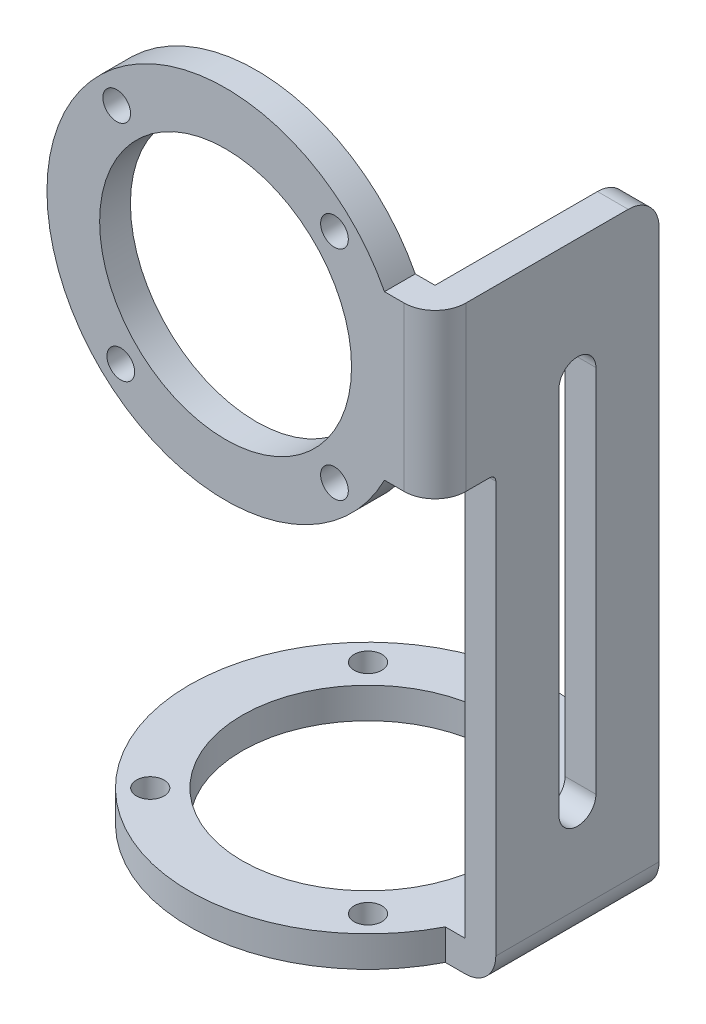
ISO-10303-21;
HEADER;
FILE_DESCRIPTION(('STEP AP214'),'2;1');
FILE_NAME('part.step','',(''),(''),'','','');
FILE_SCHEMA(('AUTOMOTIVE_DESIGN { 1 0 10303 214 1 1 1 1 }'));
ENDSEC;
DATA;
#1=APPLICATION_CONTEXT('core data for automotive mechanical design processes');
#2=APPLICATION_PROTOCOL_DEFINITION('international standard','automotive_design',2000,#1);
#3=PRODUCT_CONTEXT('',#1,'mechanical');
#4=PRODUCT('Part','Part','',(#3));
#5=PRODUCT_RELATED_PRODUCT_CATEGORY('part','',(#4));
#6=PRODUCT_DEFINITION_FORMATION('','',#4);
#7=PRODUCT_DEFINITION_CONTEXT('part definition',#1,'design');
#8=PRODUCT_DEFINITION('design','',#6,#7);
#9=PRODUCT_DEFINITION_SHAPE('','',#8);
#10=(LENGTH_UNIT() NAMED_UNIT(*) SI_UNIT(.MILLI.,.METRE.));
#11=(NAMED_UNIT(*) PLANE_ANGLE_UNIT() SI_UNIT($,.RADIAN.));
#12=(NAMED_UNIT(*) SI_UNIT($,.STERADIAN.) SOLID_ANGLE_UNIT());
#13=UNCERTAINTY_MEASURE_WITH_UNIT(LENGTH_MEASURE(1.E-05),#10,'distance_accuracy_value','');
#14=(GEOMETRIC_REPRESENTATION_CONTEXT(3) GLOBAL_UNCERTAINTY_ASSIGNED_CONTEXT((#13)) GLOBAL_UNIT_ASSIGNED_CONTEXT((#10,
#11,#12)) REPRESENTATION_CONTEXT('',''));
#15=CARTESIAN_POINT('',(0.,0.,0.));
#16=DIRECTION('',(0.,0.,1.));
#17=DIRECTION('',(1.,0.,0.));
#18=AXIS2_PLACEMENT_3D('',#15,#16,#17);
#19=CARTESIAN_POINT('',(34.,8.24999999999991,-26.375));
#20=DIRECTION('',(-1.,0.,0.));
#21=DIRECTION('',(0.,0.,1.));
#22=AXIS2_PLACEMENT_3D('',#19,#20,#21);
#23=PLANE('',#22);
#24=DIRECTION('',(0.,0.,-1.));
#25=VECTOR('',#24,1.);
#26=CARTESIAN_POINT('',(34.,-13.25,0.));
#27=LINE('',#26,#25);
#28=CARTESIAN_POINT('',(34.,-13.25,0.));
#29=VERTEX_POINT('',#28);
#30=CARTESIAN_POINT('',(34.,-13.25,-3.875));
#31=VERTEX_POINT('',#30);
#32=EDGE_CURVE('E207',#29,#31,#27,.T.);
#33=ORIENTED_EDGE('',*,*,#32,.T.);
#34=CARTESIAN_POINT('',(34.,-14.25,-3.875));
#35=DIRECTION('',(1.,0.,0.));
#36=DIRECTION('',(0.,0.,-1.));
#37=AXIS2_PLACEMENT_3D('',#34,#35,#36);
#38=CIRCLE('',#37,1.);
#39=CARTESIAN_POINT('',(34.,-14.25,-4.87499999999998));
#40=VERTEX_POINT('',#39);
#41=EDGE_CURVE('E228',#40,#31,#38,.T.);
#42=ORIENTED_EDGE('',*,*,#41,.F.);
#43=DIRECTION('',(0.,1.,0.));
#44=VECTOR('',#43,1.);
#45=CARTESIAN_POINT('',(34.,-81.,-4.87499999999998));
#46=LINE('',#45,#44);
#47=CARTESIAN_POINT('',(34.,-81.,-4.87499999999998));
#48=VERTEX_POINT('',#47);
#49=EDGE_CURVE('E216',#48,#40,#46,.T.);
#50=ORIENTED_EDGE('',*,*,#49,.F.);
#51=DIRECTION('',(0.,0.,1.));
#52=VECTOR('',#51,1.);
#53=CARTESIAN_POINT('',(34.,-81.,-31.375));
#54=LINE('',#53,#52);
#55=CARTESIAN_POINT('',(34.,-81.,-31.375));
#56=VERTEX_POINT('',#55);
#57=EDGE_CURVE('E336',#56,#48,#54,.T.);
#58=ORIENTED_EDGE('',*,*,#57,.F.);
#59=DIRECTION('',(0.,-1.,0.));
#60=VECTOR('',#59,1.);
#61=CARTESIAN_POINT('',(34.,8.24999999999988,-31.375));
#62=LINE('',#61,#60);
#63=CARTESIAN_POINT('',(34.,8.24999999999988,-31.375));
#64=VERTEX_POINT('',#63);
#65=EDGE_CURVE('E241',#64,#56,#62,.T.);
#66=ORIENTED_EDGE('',*,*,#65,.F.);
#67=CARTESIAN_POINT('',(34.,8.24999999999991,-26.375));
#68=DIRECTION('',(-1.,0.,0.));
#69=DIRECTION('',(0.,0.,1.));
#70=AXIS2_PLACEMENT_3D('',#67,#68,#69);
#71=CIRCLE('',#70,5.);
#72=CARTESIAN_POINT('',(34.,13.2499999999999,-26.375));
#73=VERTEX_POINT('',#72);
#74=EDGE_CURVE('E245',#73,#64,#71,.T.);
#75=ORIENTED_EDGE('',*,*,#74,.F.);
#76=DIRECTION('',(0.,0.,-1.));
#77=VECTOR('',#76,1.);
#78=CARTESIAN_POINT('',(34.,13.2499999999999,0.));
#79=LINE('',#78,#77);
#80=CARTESIAN_POINT('',(34.,13.2499999999999,0.));
#81=VERTEX_POINT('',#80);
#82=EDGE_CURVE('E250',#81,#73,#79,.T.);
#83=ORIENTED_EDGE('',*,*,#82,.F.);
#84=DIRECTION('',(0.,1.,0.));
#85=VECTOR('',#84,1.);
#86=CARTESIAN_POINT('',(34.,-13.25,0.));
#87=LINE('',#86,#85);
#88=EDGE_CURVE('E282',#29,#81,#87,.T.);
#89=ORIENTED_EDGE('',*,*,#88,.F.);
#90=EDGE_LOOP('',(#33,#42,#50,#58,#66,#75,#83,#89));
#91=FACE_BOUND('',#90,.T.);
#92=DIRECTION('',(0.,-1.,0.));
#93=VECTOR('',#92,1.);
#94=CARTESIAN_POINT('',(34.,0.,-21.125));
#95=LINE('',#94,#93);
#96=CARTESIAN_POINT('',(34.,-6.37500000000002,-21.125));
#97=VERTEX_POINT('',#96);
#98=CARTESIAN_POINT('',(34.,-66.375,-21.125));
#99=VERTEX_POINT('',#98);
#100=EDGE_CURVE('E67',#97,#99,#95,.T.);
#101=ORIENTED_EDGE('',*,*,#100,.T.);
#102=CARTESIAN_POINT('',(34.,-66.375,-18.125));
#103=DIRECTION('',(1.,0.,0.));
#104=DIRECTION('',(0.,0.,-1.));
#105=AXIS2_PLACEMENT_3D('',#102,#103,#104);
#106=CIRCLE('',#105,3.);
#107=CARTESIAN_POINT('',(34.,-66.375,-15.125));
#108=VERTEX_POINT('',#107);
#109=EDGE_CURVE('E196',#99,#108,#106,.F.);
#110=ORIENTED_EDGE('',*,*,#109,.T.);
#111=DIRECTION('',(0.,-1.,0.));
#112=VECTOR('',#111,1.);
#113=CARTESIAN_POINT('',(34.,0.,-15.125));
#114=LINE('',#113,#112);
#115=CARTESIAN_POINT('',(34.,-6.37500000000002,-15.125));
#116=VERTEX_POINT('',#115);
#117=EDGE_CURVE('E180',#116,#108,#114,.T.);
#118=ORIENTED_EDGE('',*,*,#117,.F.);
#119=CARTESIAN_POINT('',(34.,-6.37500000000002,-18.125));
#120=DIRECTION('',(1.,0.,0.));
#121=DIRECTION('',(0.,0.,-1.));
#122=AXIS2_PLACEMENT_3D('',#119,#120,#121);
#123=CIRCLE('',#122,2.99999999999999);
#124=EDGE_CURVE('E190',#97,#116,#123,.T.);
#125=ORIENTED_EDGE('',*,*,#124,.F.);
#126=EDGE_LOOP('',(#101,#110,#118,#125));
#127=FACE_BOUND('',#126,.T.);
#128=ADVANCED_FACE('F49',(#91,#127),#23,.F.);
#129=CARTESIAN_POINT('',(29.,8.24999999999991,-26.375));
#130=DIRECTION('',(-1.,0.,0.));
#131=DIRECTION('',(0.,0.,1.));
#132=AXIS2_PLACEMENT_3D('',#129,#130,#131);
#133=PLANE('',#132);
#134=CARTESIAN_POINT('',(29.,-14.25,-3.87499999999999));
#135=DIRECTION('',(1.,0.,0.));
#136=DIRECTION('',(0.,0.,-1.));
#137=AXIS2_PLACEMENT_3D('',#134,#135,#136);
#138=CIRCLE('',#137,1.);
#139=CARTESIAN_POINT('',(29.,-14.25,-4.875));
#140=VERTEX_POINT('',#139);
#141=CARTESIAN_POINT('',(29.,-13.25,-3.87499999999999));
#142=VERTEX_POINT('',#141);
#143=EDGE_CURVE('E215',#140,#142,#138,.T.);
#144=ORIENTED_EDGE('',*,*,#143,.T.);
#145=DIRECTION('',(0.,0.,-1.));
#146=VECTOR('',#145,1.);
#147=CARTESIAN_POINT('',(29.,-13.25,0.));
#148=LINE('',#147,#146);
#149=CARTESIAN_POINT('',(29.,-13.25,0.));
#150=VERTEX_POINT('',#149);
#151=EDGE_CURVE('E212',#150,#142,#148,.T.);
#152=ORIENTED_EDGE('',*,*,#151,.F.);
#153=DIRECTION('',(0.,-1.,0.));
#154=VECTOR('',#153,1.);
#155=CARTESIAN_POINT('',(29.,-13.25,0.));
#156=LINE('',#155,#154);
#157=CARTESIAN_POINT('',(29.,13.2499999999999,0.));
#158=VERTEX_POINT('',#157);
#159=EDGE_CURVE('E240',#158,#150,#156,.T.);
#160=ORIENTED_EDGE('',*,*,#159,.F.);
#161=DIRECTION('',(0.,0.,-1.));
#162=VECTOR('',#161,1.);
#163=CARTESIAN_POINT('',(29.,13.2499999999999,0.));
#164=LINE('',#163,#162);
#165=CARTESIAN_POINT('',(29.,13.2499999999999,-26.375));
#166=VERTEX_POINT('',#165);
#167=EDGE_CURVE('E246',#158,#166,#164,.T.);
#168=ORIENTED_EDGE('',*,*,#167,.T.);
#169=CARTESIAN_POINT('',(29.,8.24999999999991,-26.375));
#170=DIRECTION('',(-1.,0.,0.));
#171=DIRECTION('',(0.,0.,1.));
#172=AXIS2_PLACEMENT_3D('',#169,#170,#171);
#173=CIRCLE('',#172,5.);
#174=CARTESIAN_POINT('',(29.,8.24999999999988,-31.375));
#175=VERTEX_POINT('',#174);
#176=EDGE_CURVE('E265',#166,#175,#173,.T.);
#177=ORIENTED_EDGE('',*,*,#176,.T.);
#178=DIRECTION('',(0.,-1.,0.));
#179=VECTOR('',#178,1.);
#180=CARTESIAN_POINT('',(29.,8.24999999999988,-31.375));
#181=LINE('',#180,#179);
#182=CARTESIAN_POINT('',(29.,-81.,-31.375));
#183=VERTEX_POINT('',#182);
#184=EDGE_CURVE('E262',#175,#183,#181,.T.);
#185=ORIENTED_EDGE('',*,*,#184,.T.);
#186=DIRECTION('',(0.,0.,-1.));
#187=VECTOR('',#186,1.);
#188=CARTESIAN_POINT('',(29.,-81.,0.));
#189=LINE('',#188,#187);
#190=CARTESIAN_POINT('',(29.,-81.,-4.875));
#191=VERTEX_POINT('',#190);
#192=EDGE_CURVE('E258',#191,#183,#189,.T.);
#193=ORIENTED_EDGE('',*,*,#192,.F.);
#194=DIRECTION('',(0.,1.,0.));
#195=VECTOR('',#194,1.);
#196=CARTESIAN_POINT('',(29.,-81.,-4.875));
#197=LINE('',#196,#195);
#198=EDGE_CURVE('E220',#191,#140,#197,.T.);
#199=ORIENTED_EDGE('',*,*,#198,.T.);
#200=EDGE_LOOP('',(#144,#152,#160,#168,#177,#185,#193,#199));
#201=FACE_BOUND('',#200,.T.);
#202=CARTESIAN_POINT('',(29.,-66.375,-18.125));
#203=DIRECTION('',(-1.,0.,0.));
#204=DIRECTION('',(0.,0.,1.));
#205=AXIS2_PLACEMENT_3D('',#202,#203,#204);
#206=CIRCLE('',#205,3.);
#207=CARTESIAN_POINT('',(29.,-66.375,-15.125));
#208=VERTEX_POINT('',#207);
#209=CARTESIAN_POINT('',(29.0000000000001,-66.375,-21.125));
#210=VERTEX_POINT('',#209);
#211=EDGE_CURVE('E59',#208,#210,#206,.F.);
#212=ORIENTED_EDGE('',*,*,#211,.T.);
#213=DIRECTION('',(0.,1.,0.));
#214=VECTOR('',#213,1.);
#215=CARTESIAN_POINT('',(29.,8.24999999999991,-21.125));
#216=LINE('',#215,#214);
#217=CARTESIAN_POINT('',(29.,-6.37500000000002,-21.125));
#218=VERTEX_POINT('',#217);
#219=EDGE_CURVE('E11',#210,#218,#216,.T.);
#220=ORIENTED_EDGE('',*,*,#219,.T.);
#221=CARTESIAN_POINT('',(29.,-6.37500000000002,-18.125));
#222=DIRECTION('',(-1.,0.,0.));
#223=DIRECTION('',(0.,0.,1.));
#224=AXIS2_PLACEMENT_3D('',#221,#222,#223);
#225=CIRCLE('',#224,2.99999999999999);
#226=CARTESIAN_POINT('',(29.,-6.37500000000002,-15.125));
#227=VERTEX_POINT('',#226);
#228=EDGE_CURVE('E385',#227,#218,#225,.T.);
#229=ORIENTED_EDGE('',*,*,#228,.F.);
#230=DIRECTION('',(0.,1.,0.));
#231=VECTOR('',#230,1.);
#232=CARTESIAN_POINT('',(29.,8.24999999999991,-15.125));
#233=LINE('',#232,#231);
#234=EDGE_CURVE('E183',#208,#227,#233,.T.);
#235=ORIENTED_EDGE('',*,*,#234,.F.);
#236=EDGE_LOOP('',(#212,#220,#229,#235));
#237=FACE_BOUND('',#236,.T.);
#238=ADVANCED_FACE('F513',(#201,#237),#133,.T.);
#239=CARTESIAN_POINT('',(0.,-86.,-18.125));
#240=DIRECTION('',(0.,1.,0.));
#241=DIRECTION('',(0.,0.,1.));
#242=AXIS2_PLACEMENT_3D('',#239,#240,#241);
#243=CYLINDRICAL_SURFACE('',#242,29.);
#244=CARTESIAN_POINT('',(0.,-81.,-18.125));
#245=DIRECTION('',(0.,-1.,0.));
#246=DIRECTION('',(0.,0.,-1.));
#247=AXIS2_PLACEMENT_3D('',#244,#245,#246);
#248=CIRCLE('',#247,29.);
#249=CARTESIAN_POINT('',(25.7960752828798,-81.,-4.87499999999996));
#250=VERTEX_POINT('',#249);
#251=CARTESIAN_POINT('',(25.7960752828798,-81.,-31.375));
#252=VERTEX_POINT('',#251);
#253=EDGE_CURVE('E343',#250,#252,#248,.T.);
#254=ORIENTED_EDGE('',*,*,#253,.T.);
#255=DIRECTION('',(0.,1.,0.));
#256=VECTOR('',#255,1.);
#257=CARTESIAN_POINT('',(25.7960752828798,-86.,-31.375));
#258=LINE('',#257,#256);
#259=CARTESIAN_POINT('',(25.7960752828798,-86.,-31.375));
#260=VERTEX_POINT('',#259);
#261=EDGE_CURVE('E381',#260,#252,#258,.T.);
#262=ORIENTED_EDGE('',*,*,#261,.F.);
#263=CARTESIAN_POINT('',(0.,-86.,-18.125));
#264=DIRECTION('',(0.,-1.,0.));
#265=DIRECTION('',(0.,0.,-1.));
#266=AXIS2_PLACEMENT_3D('',#263,#264,#265);
#267=CIRCLE('',#266,29.);
#268=CARTESIAN_POINT('',(25.7960752828798,-86.,-4.87499999999996));
#269=VERTEX_POINT('',#268);
#270=EDGE_CURVE('E344',#269,#260,#267,.T.);
#271=ORIENTED_EDGE('',*,*,#270,.F.);
#272=DIRECTION('',(0.,1.,0.));
#273=VECTOR('',#272,1.);
#274=CARTESIAN_POINT('',(25.7960752828798,-86.,-4.87499999999996));
#275=LINE('',#274,#273);
#276=EDGE_CURVE('E364',#269,#250,#275,.T.);
#277=ORIENTED_EDGE('',*,*,#276,.T.);
#278=EDGE_LOOP('',(#254,#262,#271,#277));
#279=FACE_BOUND('',#278,.T.);
#280=ADVANCED_FACE('F51',(#279),#243,.T.);
#281=CARTESIAN_POINT('',(0.,-86.,-31.375));
#282=DIRECTION('',(0.,0.,1.));
#283=DIRECTION('',(1.,0.,0.));
#284=AXIS2_PLACEMENT_3D('',#281,#282,#283);
#285=PLANE('',#284);
#286=DIRECTION('',(1.,0.,0.));
#287=VECTOR('',#286,1.);
#288=CARTESIAN_POINT('',(0.,-81.,-31.375));
#289=LINE('',#288,#287);
#290=EDGE_CURVE('E368',#252,#183,#289,.T.);
#291=ORIENTED_EDGE('',*,*,#290,.T.);
#292=ORIENTED_EDGE('',*,*,#184,.F.);
#293=DIRECTION('',(-1.,0.,0.));
#294=VECTOR('',#293,1.);
#295=CARTESIAN_POINT('',(34.,8.24999999999988,-31.375));
#296=LINE('',#295,#294);
#297=EDGE_CURVE('E274',#64,#175,#296,.T.);
#298=ORIENTED_EDGE('',*,*,#297,.F.);
#299=ORIENTED_EDGE('',*,*,#65,.T.);
#300=CARTESIAN_POINT('',(29.,-81.,-31.375));
#301=DIRECTION('',(0.,0.,1.));
#302=DIRECTION('',(1.,0.,0.));
#303=AXIS2_PLACEMENT_3D('',#300,#301,#302);
#304=CIRCLE('',#303,5.);
#305=CARTESIAN_POINT('',(29.,-86.,-31.375));
#306=VERTEX_POINT('',#305);
#307=EDGE_CURVE('E332',#306,#56,#304,.T.);
#308=ORIENTED_EDGE('',*,*,#307,.F.);
#309=DIRECTION('',(1.,0.,0.));
#310=VECTOR('',#309,1.);
#311=CARTESIAN_POINT('',(0.,-86.,-31.375));
#312=LINE('',#311,#310);
#313=EDGE_CURVE('E348',#260,#306,#312,.T.);
#314=ORIENTED_EDGE('',*,*,#313,.F.);
#315=ORIENTED_EDGE('',*,*,#261,.T.);
#316=EDGE_LOOP('',(#291,#292,#298,#299,#308,#314,#315));
#317=FACE_BOUND('',#316,.T.);
#318=ADVANCED_FACE('F581',(#317),#285,.F.);
#319=CARTESIAN_POINT('',(0.,-86.,-4.87499999999999));
#320=DIRECTION('',(0.,0.,1.));
#321=DIRECTION('',(1.,0.,0.));
#322=AXIS2_PLACEMENT_3D('',#319,#320,#321);
#323=PLANE('',#322);
#324=DIRECTION('',(1.,0.,0.));
#325=VECTOR('',#324,1.);
#326=CARTESIAN_POINT('',(0.,-81.,-4.87499999999999));
#327=LINE('',#326,#325);
#328=EDGE_CURVE('E372',#250,#191,#327,.T.);
#329=ORIENTED_EDGE('',*,*,#328,.F.);
#330=ORIENTED_EDGE('',*,*,#276,.F.);
#331=DIRECTION('',(1.,0.,0.));
#332=VECTOR('',#331,1.);
#333=CARTESIAN_POINT('',(0.,-86.,-4.87499999999999));
#334=LINE('',#333,#332);
#335=CARTESIAN_POINT('',(29.,-86.,-4.875));
#336=VERTEX_POINT('',#335);
#337=EDGE_CURVE('E356',#269,#336,#334,.T.);
#338=ORIENTED_EDGE('',*,*,#337,.T.);
#339=CARTESIAN_POINT('',(29.,-81.,-4.875));
#340=DIRECTION('',(0.,0.,1.));
#341=DIRECTION('',(1.,0.,0.));
#342=AXIS2_PLACEMENT_3D('',#339,#340,#341);
#343=CIRCLE('',#342,5.);
#344=EDGE_CURVE('E331',#336,#48,#343,.T.);
#345=ORIENTED_EDGE('',*,*,#344,.T.);
#346=ORIENTED_EDGE('',*,*,#49,.T.);
#347=DIRECTION('',(1.,0.,0.));
#348=VECTOR('',#347,1.);
#349=CARTESIAN_POINT('',(29.,-14.25,-4.875));
#350=LINE('',#349,#348);
#351=EDGE_CURVE('E224',#140,#40,#350,.T.);
#352=ORIENTED_EDGE('',*,*,#351,.F.);
#353=ORIENTED_EDGE('',*,*,#198,.F.);
#354=EDGE_LOOP('',(#329,#330,#338,#345,#346,#352,#353));
#355=FACE_BOUND('',#354,.T.);
#356=ADVANCED_FACE('F497',(#355),#323,.T.);
#357=CARTESIAN_POINT('',(0.,-86.,-18.125));
#358=DIRECTION('',(0.,1.,0.));
#359=DIRECTION('',(0.,0.,1.));
#360=AXIS2_PLACEMENT_3D('',#357,#358,#359);
#361=CYLINDRICAL_SURFACE('',#360,20.45);
#362=CARTESIAN_POINT('',(0.,-86.,-18.125));
#363=DIRECTION('',(0.,-1.,0.));
#364=DIRECTION('',(0.,0.,-1.));
#365=AXIS2_PLACEMENT_3D('',#362,#363,#364);
#366=CIRCLE('',#365,20.45);
#367=CARTESIAN_POINT('',(0.,-86.,-38.575));
#368=VERTEX_POINT('',#367);
#369=EDGE_CURVE('E360',#368,#368,#366,.T.);
#370=ORIENTED_EDGE('',*,*,#369,.T.);
#371=EDGE_LOOP('',(#370));
#372=FACE_BOUND('',#371,.T.);
#373=CARTESIAN_POINT('',(0.,-81.,-18.125));
#374=DIRECTION('',(0.,-1.,0.));
#375=DIRECTION('',(0.,0.,-1.));
#376=AXIS2_PLACEMENT_3D('',#373,#374,#375);
#377=CIRCLE('',#376,20.45);
#378=CARTESIAN_POINT('',(0.,-81.,-38.575));
#379=VERTEX_POINT('',#378);
#380=EDGE_CURVE('E349',#379,#379,#377,.T.);
#381=ORIENTED_EDGE('',*,*,#380,.F.);
#382=EDGE_LOOP('',(#381));
#383=FACE_BOUND('',#382,.T.);
#384=ADVANCED_FACE('F484',(#372,#383),#361,.F.);
#385=CARTESIAN_POINT('',(0.,-86.,0.));
#386=DIRECTION('',(0.,-1.,0.));
#387=DIRECTION('',(0.,0.,-1.));
#388=AXIS2_PLACEMENT_3D('',#385,#386,#387);
#389=PLANE('',#388);
#390=CARTESIAN_POINT('',(-17.6776695296635,-86.,-35.8026695296638));
#391=DIRECTION('',(0.,-1.,0.));
#392=DIRECTION('',(0.,0.,-1.));
#393=AXIS2_PLACEMENT_3D('',#390,#391,#392);
#394=CIRCLE('',#393,2.25);
#395=CARTESIAN_POINT('',(-17.6776695296635,-86.,-38.0526695296638));
#396=VERTEX_POINT('',#395);
#397=EDGE_CURVE('E464',#396,#396,#394,.T.);
#398=ORIENTED_EDGE('',*,*,#397,.F.);
#399=EDGE_LOOP('',(#398));
#400=FACE_BOUND('',#399,.T.);
#401=CARTESIAN_POINT('',(17.6776695296639,-86.,-35.8026695296635));
#402=DIRECTION('',(0.,-1.,0.));
#403=DIRECTION('',(0.,0.,-1.));
#404=AXIS2_PLACEMENT_3D('',#401,#402,#403);
#405=CIRCLE('',#404,2.25);
#406=CARTESIAN_POINT('',(17.6776695296639,-86.,-38.0526695296635));
#407=VERTEX_POINT('',#406);
#408=EDGE_CURVE('E468',#407,#407,#405,.T.);
#409=ORIENTED_EDGE('',*,*,#408,.F.);
#410=EDGE_LOOP('',(#409));
#411=FACE_BOUND('',#410,.T.);
#412=CARTESIAN_POINT('',(17.6776695296637,-86.,-0.447330470336266));
#413=DIRECTION('',(0.,-1.,0.));
#414=DIRECTION('',(0.,0.,-1.));
#415=AXIS2_PLACEMENT_3D('',#412,#413,#414);
#416=CIRCLE('',#415,2.25);
#417=CARTESIAN_POINT('',(17.6776695296637,-86.,-2.69733047033626));
#418=VERTEX_POINT('',#417);
#419=EDGE_CURVE('E463',#418,#418,#416,.T.);
#420=ORIENTED_EDGE('',*,*,#419,.F.);
#421=EDGE_LOOP('',(#420));
#422=FACE_BOUND('',#421,.T.);
#423=CARTESIAN_POINT('',(-17.6776695296638,-86.,-0.447330470336432));
#424=DIRECTION('',(0.,-1.,0.));
#425=DIRECTION('',(0.,0.,-1.));
#426=AXIS2_PLACEMENT_3D('',#423,#424,#425);
#427=CIRCLE('',#426,2.25);
#428=CARTESIAN_POINT('',(-17.6776695296638,-86.,-2.69733047033643));
#429=VERTEX_POINT('',#428);
#430=EDGE_CURVE('E415',#429,#429,#427,.T.);
#431=ORIENTED_EDGE('',*,*,#430,.F.);
#432=EDGE_LOOP('',(#431));
#433=FACE_BOUND('',#432,.T.);
#434=ORIENTED_EDGE('',*,*,#270,.T.);
#435=ORIENTED_EDGE('',*,*,#313,.T.);
#436=DIRECTION('',(0.,0.,-1.));
#437=VECTOR('',#436,1.);
#438=CARTESIAN_POINT('',(29.,-86.,0.));
#439=LINE('',#438,#437);
#440=EDGE_CURVE('E352',#336,#306,#439,.T.);
#441=ORIENTED_EDGE('',*,*,#440,.F.);
#442=ORIENTED_EDGE('',*,*,#337,.F.);
#443=EDGE_LOOP('',(#434,#435,#441,#442));
#444=FACE_BOUND('',#443,.T.);
#445=ORIENTED_EDGE('',*,*,#369,.F.);
#446=EDGE_LOOP('',(#445));
#447=FACE_BOUND('',#446,.T.);
#448=ADVANCED_FACE('F480',(#400,#411,#422,#433,#444,#447),#389,.T.);
#449=CARTESIAN_POINT('',(0.,-81.,0.));
#450=DIRECTION('',(0.,-1.,0.));
#451=DIRECTION('',(0.,0.,-1.));
#452=AXIS2_PLACEMENT_3D('',#449,#450,#451);
#453=PLANE('',#452);
#454=CARTESIAN_POINT('',(-17.6776695296635,-81.,-35.8026695296638));
#455=DIRECTION('',(0.,-1.,0.));
#456=DIRECTION('',(0.,0.,-1.));
#457=AXIS2_PLACEMENT_3D('',#454,#455,#456);
#458=CIRCLE('',#457,2.25);
#459=CARTESIAN_POINT('',(-17.6776695296635,-81.,-38.0526695296638));
#460=VERTEX_POINT('',#459);
#461=EDGE_CURVE('E53',#460,#460,#458,.T.);
#462=ORIENTED_EDGE('',*,*,#461,.T.);
#463=EDGE_LOOP('',(#462));
#464=FACE_BOUND('',#463,.T.);
#465=CARTESIAN_POINT('',(17.6776695296639,-81.,-35.8026695296635));
#466=DIRECTION('',(0.,-1.,0.));
#467=DIRECTION('',(0.,0.,-1.));
#468=AXIS2_PLACEMENT_3D('',#465,#466,#467);
#469=CIRCLE('',#468,2.25);
#470=CARTESIAN_POINT('',(17.6776695296639,-81.,-38.0526695296635));
#471=VERTEX_POINT('',#470);
#472=EDGE_CURVE('E418',#471,#471,#469,.T.);
#473=ORIENTED_EDGE('',*,*,#472,.T.);
#474=EDGE_LOOP('',(#473));
#475=FACE_BOUND('',#474,.T.);
#476=CARTESIAN_POINT('',(17.6776695296637,-81.,-0.447330470336266));
#477=DIRECTION('',(0.,-1.,0.));
#478=DIRECTION('',(0.,0.,-1.));
#479=AXIS2_PLACEMENT_3D('',#476,#477,#478);
#480=CIRCLE('',#479,2.25);
#481=CARTESIAN_POINT('',(17.6776695296637,-81.,-2.69733047033626));
#482=VERTEX_POINT('',#481);
#483=EDGE_CURVE('E414',#482,#482,#480,.T.);
#484=ORIENTED_EDGE('',*,*,#483,.T.);
#485=EDGE_LOOP('',(#484));
#486=FACE_BOUND('',#485,.T.);
#487=CARTESIAN_POINT('',(-17.6776695296638,-81.,-0.447330470336432));
#488=DIRECTION('',(0.,-1.,0.));
#489=DIRECTION('',(0.,0.,-1.));
#490=AXIS2_PLACEMENT_3D('',#487,#488,#489);
#491=CIRCLE('',#490,2.25);
#492=CARTESIAN_POINT('',(-17.6776695296638,-81.,-2.69733047033643));
#493=VERTEX_POINT('',#492);
#494=EDGE_CURVE('E410',#493,#493,#491,.T.);
#495=ORIENTED_EDGE('',*,*,#494,.T.);
#496=EDGE_LOOP('',(#495));
#497=FACE_BOUND('',#496,.T.);
#498=ORIENTED_EDGE('',*,*,#328,.T.);
#499=ORIENTED_EDGE('',*,*,#192,.T.);
#500=ORIENTED_EDGE('',*,*,#290,.F.);
#501=ORIENTED_EDGE('',*,*,#253,.F.);
#502=EDGE_LOOP('',(#498,#499,#500,#501));
#503=FACE_BOUND('',#502,.T.);
#504=ORIENTED_EDGE('',*,*,#380,.T.);
#505=EDGE_LOOP('',(#504));
#506=FACE_BOUND('',#505,.T.);
#507=ADVANCED_FACE('F483',(#464,#475,#486,#497,#503,#506),#453,.F.);
#508=CARTESIAN_POINT('',(29.,-81.,-31.375));
#509=DIRECTION('',(0.,0.,1.));
#510=DIRECTION('',(1.,0.,0.));
#511=AXIS2_PLACEMENT_3D('',#508,#509,#510);
#512=CYLINDRICAL_SURFACE('',#511,5.);
#513=ORIENTED_EDGE('',*,*,#344,.F.);
#514=ORIENTED_EDGE('',*,*,#440,.T.);
#515=ORIENTED_EDGE('',*,*,#307,.T.);
#516=ORIENTED_EDGE('',*,*,#57,.T.);
#517=EDGE_LOOP('',(#513,#514,#515,#516));
#518=FACE_BOUND('',#517,.T.);
#519=ADVANCED_FACE('F502',(#518),#512,.T.);
#520=CARTESIAN_POINT('',(0.,0.,4.99999999999998));
#521=DIRECTION('',(0.,0.,-1.));
#522=DIRECTION('',(-1.,0.,0.));
#523=AXIS2_PLACEMENT_3D('',#520,#521,#522);
#524=CYLINDRICAL_SURFACE('',#523,29.);
#525=CARTESIAN_POINT('',(0.,0.,0.));
#526=DIRECTION('',(0.,0.,1.));
#527=DIRECTION('',(1.,0.,0.));
#528=AXIS2_PLACEMENT_3D('',#525,#526,#527);
#529=CIRCLE('',#528,29.);
#530=CARTESIAN_POINT('',(25.7960752828798,13.2499999999999,0.));
#531=VERTEX_POINT('',#530);
#532=CARTESIAN_POINT('',(25.7960752828798,-13.25,0.));
#533=VERTEX_POINT('',#532);
#534=EDGE_CURVE('E289',#531,#533,#529,.T.);
#535=ORIENTED_EDGE('',*,*,#534,.T.);
#536=DIRECTION('',(0.,0.,-1.));
#537=VECTOR('',#536,1.);
#538=CARTESIAN_POINT('',(25.7960752828798,-13.25,4.99999999999998));
#539=LINE('',#538,#537);
#540=CARTESIAN_POINT('',(25.7960752828798,-13.25,4.99999999999998));
#541=VERTEX_POINT('',#540);
#542=EDGE_CURVE('E327',#541,#533,#539,.T.);
#543=ORIENTED_EDGE('',*,*,#542,.F.);
#544=CARTESIAN_POINT('',(0.,0.,4.99999999999998));
#545=DIRECTION('',(0.,0.,1.));
#546=DIRECTION('',(1.,0.,0.));
#547=AXIS2_PLACEMENT_3D('',#544,#545,#546);
#548=CIRCLE('',#547,29.);
#549=CARTESIAN_POINT('',(25.7960752828797,13.2499999999999,4.99999999999999));
#550=VERTEX_POINT('',#549);
#551=EDGE_CURVE('E290',#550,#541,#548,.T.);
#552=ORIENTED_EDGE('',*,*,#551,.F.);
#553=DIRECTION('',(0.,0.,-1.));
#554=VECTOR('',#553,1.);
#555=CARTESIAN_POINT('',(25.7960752828797,13.2499999999999,4.99999999999999));
#556=LINE('',#555,#554);
#557=EDGE_CURVE('E310',#550,#531,#556,.T.);
#558=ORIENTED_EDGE('',*,*,#557,.T.);
#559=EDGE_LOOP('',(#535,#543,#552,#558));
#560=FACE_BOUND('',#559,.T.);
#561=ADVANCED_FACE('F509',(#560),#524,.T.);
#562=CARTESIAN_POINT('',(0.,-13.25,4.99999999999995));
#563=DIRECTION('',(0.,1.,0.));
#564=DIRECTION('',(-1.,0.,0.));
#565=AXIS2_PLACEMENT_3D('',#562,#563,#564);
#566=PLANE('',#565);
#567=DIRECTION('',(1.,0.,0.));
#568=VECTOR('',#567,1.);
#569=CARTESIAN_POINT('',(0.,-13.25,0.));
#570=LINE('',#569,#568);
#571=EDGE_CURVE('E314',#533,#150,#570,.T.);
#572=ORIENTED_EDGE('',*,*,#571,.T.);
#573=ORIENTED_EDGE('',*,*,#151,.T.);
#574=DIRECTION('',(1.,0.,0.));
#575=VECTOR('',#574,1.);
#576=CARTESIAN_POINT('',(29.,-13.25,-3.87499999999999));
#577=LINE('',#576,#575);
#578=EDGE_CURVE('E237',#142,#31,#577,.T.);
#579=ORIENTED_EDGE('',*,*,#578,.T.);
#580=ORIENTED_EDGE('',*,*,#32,.F.);
#581=CARTESIAN_POINT('',(29.,-13.25,0.));
#582=DIRECTION('',(0.,1.,0.));
#583=DIRECTION('',(0.,0.,1.));
#584=AXIS2_PLACEMENT_3D('',#581,#582,#583);
#585=CIRCLE('',#584,5.);
#586=CARTESIAN_POINT('',(29.,-13.25,5.00000000000002));
#587=VERTEX_POINT('',#586);
#588=EDGE_CURVE('E278',#587,#29,#585,.T.);
#589=ORIENTED_EDGE('',*,*,#588,.F.);
#590=DIRECTION('',(1.,0.,0.));
#591=VECTOR('',#590,1.);
#592=CARTESIAN_POINT('',(0.,-13.25,4.99999999999995));
#593=LINE('',#592,#591);
#594=EDGE_CURVE('E294',#541,#587,#593,.T.);
#595=ORIENTED_EDGE('',*,*,#594,.F.);
#596=ORIENTED_EDGE('',*,*,#542,.T.);
#597=EDGE_LOOP('',(#572,#573,#579,#580,#589,#595,#596));
#598=FACE_BOUND('',#597,.T.);
#599=ADVANCED_FACE('F550',(#598),#566,.F.);
#600=CARTESIAN_POINT('',(0.,13.25,4.99999999999998));
#601=DIRECTION('',(0.,1.,0.));
#602=DIRECTION('',(-1.,0.,0.));
#603=AXIS2_PLACEMENT_3D('',#600,#601,#602);
#604=PLANE('',#603);
#605=DIRECTION('',(1.,0.,0.));
#606=VECTOR('',#605,1.);
#607=CARTESIAN_POINT('',(0.,13.25,0.));
#608=LINE('',#607,#606);
#609=EDGE_CURVE('E318',#531,#158,#608,.T.);
#610=ORIENTED_EDGE('',*,*,#609,.F.);
#611=ORIENTED_EDGE('',*,*,#557,.F.);
#612=DIRECTION('',(1.,0.,0.));
#613=VECTOR('',#612,1.);
#614=CARTESIAN_POINT('',(0.,13.25,4.99999999999998));
#615=LINE('',#614,#613);
#616=CARTESIAN_POINT('',(29.,13.2499999999999,5.00000000000002));
#617=VERTEX_POINT('',#616);
#618=EDGE_CURVE('E302',#550,#617,#615,.T.);
#619=ORIENTED_EDGE('',*,*,#618,.T.);
#620=CARTESIAN_POINT('',(29.,13.2499999999999,0.));
#621=DIRECTION('',(0.,1.,0.));
#622=DIRECTION('',(0.,0.,1.));
#623=AXIS2_PLACEMENT_3D('',#620,#621,#622);
#624=CIRCLE('',#623,5.);
#625=EDGE_CURVE('E277',#617,#81,#624,.T.);
#626=ORIENTED_EDGE('',*,*,#625,.T.);
#627=ORIENTED_EDGE('',*,*,#82,.T.);
#628=DIRECTION('',(-1.,0.,0.));
#629=VECTOR('',#628,1.);
#630=CARTESIAN_POINT('',(34.,13.2499999999999,-26.375));
#631=LINE('',#630,#629);
#632=EDGE_CURVE('E254',#73,#166,#631,.T.);
#633=ORIENTED_EDGE('',*,*,#632,.T.);
#634=ORIENTED_EDGE('',*,*,#167,.F.);
#635=EDGE_LOOP('',(#610,#611,#619,#626,#627,#633,#634));
#636=FACE_BOUND('',#635,.T.);
#637=ADVANCED_FACE('F546',(#636),#604,.T.);
#638=CARTESIAN_POINT('',(0.,0.,4.99999999999998));
#639=DIRECTION('',(0.,0.,-1.));
#640=DIRECTION('',(-1.,0.,0.));
#641=AXIS2_PLACEMENT_3D('',#638,#639,#640);
#642=CYLINDRICAL_SURFACE('',#641,20.45);
#643=CARTESIAN_POINT('',(0.,0.,4.99999999999998));
#644=DIRECTION('',(0.,0.,1.));
#645=DIRECTION('',(1.,0.,0.));
#646=AXIS2_PLACEMENT_3D('',#643,#644,#645);
#647=CIRCLE('',#646,20.45);
#648=CARTESIAN_POINT('',(20.45,0.,4.99999999999998));
#649=VERTEX_POINT('',#648);
#650=EDGE_CURVE('E306',#649,#649,#647,.T.);
#651=ORIENTED_EDGE('',*,*,#650,.T.);
#652=EDGE_LOOP('',(#651));
#653=FACE_BOUND('',#652,.T.);
#654=CARTESIAN_POINT('',(0.,0.,0.));
#655=DIRECTION('',(0.,0.,1.));
#656=DIRECTION('',(1.,0.,0.));
#657=AXIS2_PLACEMENT_3D('',#654,#655,#656);
#658=CIRCLE('',#657,20.45);
#659=CARTESIAN_POINT('',(20.45,0.,0.));
#660=VERTEX_POINT('',#659);
#661=EDGE_CURVE('E295',#660,#660,#658,.T.);
#662=ORIENTED_EDGE('',*,*,#661,.F.);
#663=EDGE_LOOP('',(#662));
#664=FACE_BOUND('',#663,.T.);
#665=ADVANCED_FACE('F539',(#653,#664),#642,.F.);
#666=CARTESIAN_POINT('',(0.,0.,4.99999999999998));
#667=DIRECTION('',(0.,0.,1.));
#668=DIRECTION('',(1.,0.,0.));
#669=AXIS2_PLACEMENT_3D('',#666,#667,#668);
#670=PLANE('',#669);
#671=CARTESIAN_POINT('',(17.6776695296637,-17.6776695296637,4.99999999999996));
#672=DIRECTION('',(0.,0.,1.));
#673=DIRECTION('',(1.,0.,0.));
#674=AXIS2_PLACEMENT_3D('',#671,#672,#673);
#675=CIRCLE('',#674,2.25);
#676=CARTESIAN_POINT('',(19.9276695296637,-17.6776695296637,4.99999999999996));
#677=VERTEX_POINT('',#676);
#678=EDGE_CURVE('E426',#677,#677,#675,.T.);
#679=ORIENTED_EDGE('',*,*,#678,.F.);
#680=EDGE_LOOP('',(#679));
#681=FACE_BOUND('',#680,.T.);
#682=CARTESIAN_POINT('',(17.6776695296637,17.6776695296637,5.));
#683=DIRECTION('',(0.,0.,1.));
#684=DIRECTION('',(1.,0.,0.));
#685=AXIS2_PLACEMENT_3D('',#682,#683,#684);
#686=CIRCLE('',#685,2.25);
#687=CARTESIAN_POINT('',(19.9276695296637,17.6776695296637,5.));
#688=VERTEX_POINT('',#687);
#689=EDGE_CURVE('E432',#688,#688,#686,.T.);
#690=ORIENTED_EDGE('',*,*,#689,.F.);
#691=EDGE_LOOP('',(#690));
#692=FACE_BOUND('',#691,.T.);
#693=CARTESIAN_POINT('',(-17.6776695296637,17.6776695296636,5.));
#694=DIRECTION('',(0.,0.,1.));
#695=DIRECTION('',(1.,0.,0.));
#696=AXIS2_PLACEMENT_3D('',#693,#694,#695);
#697=CIRCLE('',#696,2.25);
#698=CARTESIAN_POINT('',(-15.4276695296637,17.6776695296636,5.));
#699=VERTEX_POINT('',#698);
#700=EDGE_CURVE('E439',#699,#699,#697,.T.);
#701=ORIENTED_EDGE('',*,*,#700,.F.);
#702=EDGE_LOOP('',(#701));
#703=FACE_BOUND('',#702,.T.);
#704=CARTESIAN_POINT('',(-17.0153196695528,-18.3160830021849,4.99999999999998));
#705=DIRECTION('',(0.,0.,1.));
#706=DIRECTION('',(1.,0.,0.));
#707=AXIS2_PLACEMENT_3D('',#704,#705,#706);
#708=CIRCLE('',#707,2.25);
#709=CARTESIAN_POINT('',(-14.7653196695528,-18.3160830021849,4.99999999999998));
#710=VERTEX_POINT('',#709);
#711=EDGE_CURVE('E398',#710,#710,#708,.T.);
#712=ORIENTED_EDGE('',*,*,#711,.F.);
#713=EDGE_LOOP('',(#712));
#714=FACE_BOUND('',#713,.T.);
#715=ORIENTED_EDGE('',*,*,#551,.T.);
#716=ORIENTED_EDGE('',*,*,#594,.T.);
#717=DIRECTION('',(0.,-1.,0.));
#718=VECTOR('',#717,1.);
#719=CARTESIAN_POINT('',(29.,0.,4.99999999999998));
#720=LINE('',#719,#718);
#721=EDGE_CURVE('E298',#617,#587,#720,.T.);
#722=ORIENTED_EDGE('',*,*,#721,.F.);
#723=ORIENTED_EDGE('',*,*,#618,.F.);
#724=EDGE_LOOP('',(#715,#716,#722,#723));
#725=FACE_BOUND('',#724,.T.);
#726=ORIENTED_EDGE('',*,*,#650,.F.);
#727=EDGE_LOOP('',(#726));
#728=FACE_BOUND('',#727,.T.);
#729=ADVANCED_FACE('F536',(#681,#692,#703,#714,#725,#728),#670,.T.);
#730=CARTESIAN_POINT('',(0.,0.,0.));
#731=DIRECTION('',(0.,0.,1.));
#732=DIRECTION('',(1.,0.,0.));
#733=AXIS2_PLACEMENT_3D('',#730,#731,#732);
#734=PLANE('',#733);
#735=CARTESIAN_POINT('',(17.6776695296637,-17.6776695296637,0.));
#736=DIRECTION('',(0.,0.,1.));
#737=DIRECTION('',(1.,0.,0.));
#738=AXIS2_PLACEMENT_3D('',#735,#736,#737);
#739=CIRCLE('',#738,2.25);
#740=CARTESIAN_POINT('',(19.9276695296637,-17.6776695296637,0.));
#741=VERTEX_POINT('',#740);
#742=EDGE_CURVE('E406',#741,#741,#739,.T.);
#743=ORIENTED_EDGE('',*,*,#742,.T.);
#744=EDGE_LOOP('',(#743));
#745=FACE_BOUND('',#744,.T.);
#746=CARTESIAN_POINT('',(17.6776695296637,17.6776695296637,0.));
#747=DIRECTION('',(0.,0.,1.));
#748=DIRECTION('',(1.,0.,0.));
#749=AXIS2_PLACEMENT_3D('',#746,#747,#748);
#750=CIRCLE('',#749,2.25);
#751=CARTESIAN_POINT('',(19.9276695296637,17.6776695296637,0.));
#752=VERTEX_POINT('',#751);
#753=EDGE_CURVE('E402',#752,#752,#750,.T.);
#754=ORIENTED_EDGE('',*,*,#753,.T.);
#755=EDGE_LOOP('',(#754));
#756=FACE_BOUND('',#755,.T.);
#757=CARTESIAN_POINT('',(-17.6776695296637,17.6776695296636,0.));
#758=DIRECTION('',(0.,0.,1.));
#759=DIRECTION('',(1.,0.,0.));
#760=AXIS2_PLACEMENT_3D('',#757,#758,#759);
#761=CIRCLE('',#760,2.25);
#762=CARTESIAN_POINT('',(-15.4276695296637,17.6776695296636,0.));
#763=VERTEX_POINT('',#762);
#764=EDGE_CURVE('E397',#763,#763,#761,.T.);
#765=ORIENTED_EDGE('',*,*,#764,.T.);
#766=EDGE_LOOP('',(#765));
#767=FACE_BOUND('',#766,.T.);
#768=CARTESIAN_POINT('',(-17.0153196695529,-18.3160830021849,0.));
#769=DIRECTION('',(0.,0.,1.));
#770=DIRECTION('',(1.,0.,0.));
#771=AXIS2_PLACEMENT_3D('',#768,#769,#770);
#772=CIRCLE('',#771,2.25);
#773=CARTESIAN_POINT('',(-14.7653196695529,-18.3160830021849,0.));
#774=VERTEX_POINT('',#773);
#775=EDGE_CURVE('E393',#774,#774,#772,.T.);
#776=ORIENTED_EDGE('',*,*,#775,.T.);
#777=EDGE_LOOP('',(#776));
#778=FACE_BOUND('',#777,.T.);
#779=ORIENTED_EDGE('',*,*,#609,.T.);
#780=ORIENTED_EDGE('',*,*,#159,.T.);
#781=ORIENTED_EDGE('',*,*,#571,.F.);
#782=ORIENTED_EDGE('',*,*,#534,.F.);
#783=EDGE_LOOP('',(#779,#780,#781,#782));
#784=FACE_BOUND('',#783,.T.);
#785=ORIENTED_EDGE('',*,*,#661,.T.);
#786=EDGE_LOOP('',(#785));
#787=FACE_BOUND('',#786,.T.);
#788=ADVANCED_FACE('F534',(#745,#756,#767,#778,#784,#787),#734,.F.);
#789=CARTESIAN_POINT('',(29.,-13.25,0.));
#790=DIRECTION('',(0.,1.,0.));
#791=DIRECTION('',(0.,0.,1.));
#792=AXIS2_PLACEMENT_3D('',#789,#790,#791);
#793=CYLINDRICAL_SURFACE('',#792,5.);
#794=ORIENTED_EDGE('',*,*,#625,.F.);
#795=ORIENTED_EDGE('',*,*,#721,.T.);
#796=ORIENTED_EDGE('',*,*,#588,.T.);
#797=ORIENTED_EDGE('',*,*,#88,.T.);
#798=EDGE_LOOP('',(#794,#795,#796,#797));
#799=FACE_BOUND('',#798,.T.);
#800=ADVANCED_FACE('F530',(#799),#793,.T.);
#801=CARTESIAN_POINT('',(34.,8.24999999999991,-26.375));
#802=DIRECTION('',(-1.,0.,0.));
#803=DIRECTION('',(0.,0.,1.));
#804=AXIS2_PLACEMENT_3D('',#801,#802,#803);
#805=CYLINDRICAL_SURFACE('',#804,5.);
#806=ORIENTED_EDGE('',*,*,#176,.F.);
#807=ORIENTED_EDGE('',*,*,#632,.F.);
#808=ORIENTED_EDGE('',*,*,#74,.T.);
#809=ORIENTED_EDGE('',*,*,#297,.T.);
#810=EDGE_LOOP('',(#806,#807,#808,#809));
#811=FACE_BOUND('',#810,.T.);
#812=ADVANCED_FACE('F527',(#811),#805,.T.);
#813=CARTESIAN_POINT('',(29.,-14.25,-3.87499999999999));
#814=DIRECTION('',(1.,0.,0.));
#815=DIRECTION('',(0.,0.,-1.));
#816=AXIS2_PLACEMENT_3D('',#813,#814,#815);
#817=CYLINDRICAL_SURFACE('',#816,1.);
#818=ORIENTED_EDGE('',*,*,#41,.T.);
#819=ORIENTED_EDGE('',*,*,#578,.F.);
#820=ORIENTED_EDGE('',*,*,#143,.F.);
#821=ORIENTED_EDGE('',*,*,#351,.T.);
#822=EDGE_LOOP('',(#818,#819,#820,#821));
#823=FACE_BOUND('',#822,.T.);
#824=ADVANCED_FACE('F524',(#823),#817,.F.);
#825=CARTESIAN_POINT('',(7.49999999999998,0.,-21.125));
#826=DIRECTION('',(0.,0.,1.));
#827=DIRECTION('',(0.,-1.,0.));
#828=AXIS2_PLACEMENT_3D('',#825,#826,#827);
#829=PLANE('',#828);
#830=DIRECTION('',(1.,0.,0.));
#831=VECTOR('',#830,1.);
#832=CARTESIAN_POINT('',(7.50000000000001,-66.375,-21.125));
#833=LINE('',#832,#831);
#834=EDGE_CURVE('E204',#210,#99,#833,.T.);
#835=ORIENTED_EDGE('',*,*,#834,.T.);
#836=ORIENTED_EDGE('',*,*,#100,.F.);
#837=DIRECTION('',(1.,0.,0.));
#838=VECTOR('',#837,1.);
#839=CARTESIAN_POINT('',(7.49999999999998,-6.37500000000002,-21.125));
#840=LINE('',#839,#838);
#841=EDGE_CURVE('E187',#218,#97,#840,.T.);
#842=ORIENTED_EDGE('',*,*,#841,.F.);
#843=ORIENTED_EDGE('',*,*,#219,.F.);
#844=EDGE_LOOP('',(#835,#836,#842,#843));
#845=FACE_BOUND('',#844,.T.);
#846=ADVANCED_FACE('F620',(#845),#829,.T.);
#847=CARTESIAN_POINT('',(7.49999999999998,-66.375,-18.125));
#848=DIRECTION('',(1.,0.,0.));
#849=DIRECTION('',(0.,0.,-1.));
#850=AXIS2_PLACEMENT_3D('',#847,#848,#849);
#851=CYLINDRICAL_SURFACE('',#850,3.);
#852=DIRECTION('',(1.,0.,0.));
#853=VECTOR('',#852,1.);
#854=CARTESIAN_POINT('',(7.50000000000001,-66.375,-15.125));
#855=LINE('',#854,#853);
#856=EDGE_CURVE('E186',#208,#108,#855,.T.);
#857=ORIENTED_EDGE('',*,*,#856,.T.);
#858=ORIENTED_EDGE('',*,*,#109,.F.);
#859=ORIENTED_EDGE('',*,*,#834,.F.);
#860=ORIENTED_EDGE('',*,*,#211,.F.);
#861=EDGE_LOOP('',(#857,#858,#859,#860));
#862=FACE_BOUND('',#861,.T.);
#863=ADVANCED_FACE('F732',(#862),#851,.F.);
#864=CARTESIAN_POINT('',(7.49999999999998,0.,-15.125));
#865=DIRECTION('',(0.,0.,1.));
#866=DIRECTION('',(1.,0.,0.));
#867=AXIS2_PLACEMENT_3D('',#864,#865,#866);
#868=PLANE('',#867);
#869=ORIENTED_EDGE('',*,*,#234,.T.);
#870=DIRECTION('',(1.,0.,0.));
#871=VECTOR('',#870,1.);
#872=CARTESIAN_POINT('',(7.49999999999998,-6.37500000000002,-15.125));
#873=LINE('',#872,#871);
#874=EDGE_CURVE('E75',#227,#116,#873,.T.);
#875=ORIENTED_EDGE('',*,*,#874,.T.);
#876=ORIENTED_EDGE('',*,*,#117,.T.);
#877=ORIENTED_EDGE('',*,*,#856,.F.);
#878=EDGE_LOOP('',(#869,#875,#876,#877));
#879=FACE_BOUND('',#878,.T.);
#880=ADVANCED_FACE('F177',(#879),#868,.F.);
#881=CARTESIAN_POINT('',(7.49999999999998,-6.37500000000002,-18.125));
#882=DIRECTION('',(1.,0.,0.));
#883=DIRECTION('',(0.,0.,-1.));
#884=AXIS2_PLACEMENT_3D('',#881,#882,#883);
#885=CYLINDRICAL_SURFACE('',#884,2.99999999999999);
#886=ORIENTED_EDGE('',*,*,#228,.T.);
#887=ORIENTED_EDGE('',*,*,#841,.T.);
#888=ORIENTED_EDGE('',*,*,#124,.T.);
#889=ORIENTED_EDGE('',*,*,#874,.F.);
#890=EDGE_LOOP('',(#886,#887,#888,#889));
#891=FACE_BOUND('',#890,.T.);
#892=ADVANCED_FACE('F191',(#891),#885,.F.);
#893=CARTESIAN_POINT('',(-17.0153196695529,-18.3160830021849,-5.));
#894=DIRECTION('',(0.,0.,1.));
#895=DIRECTION('',(1.,0.,0.));
#896=AXIS2_PLACEMENT_3D('',#893,#894,#895);
#897=CYLINDRICAL_SURFACE('',#896,2.25);
#898=ORIENTED_EDGE('',*,*,#711,.T.);
#899=EDGE_LOOP('',(#898));
#900=FACE_BOUND('',#899,.T.);
#901=ORIENTED_EDGE('',*,*,#775,.F.);
#902=EDGE_LOOP('',(#901));
#903=FACE_BOUND('',#902,.T.);
#904=ADVANCED_FACE('F751',(#900,#903),#897,.F.);
#905=CARTESIAN_POINT('',(-17.6776695296637,17.6776695296636,-5.));
#906=DIRECTION('',(0.,0.,1.));
#907=DIRECTION('',(1.,0.,0.));
#908=AXIS2_PLACEMENT_3D('',#905,#906,#907);
#909=CYLINDRICAL_SURFACE('',#908,2.25);
#910=ORIENTED_EDGE('',*,*,#700,.T.);
#911=EDGE_LOOP('',(#910));
#912=FACE_BOUND('',#911,.T.);
#913=ORIENTED_EDGE('',*,*,#764,.F.);
#914=EDGE_LOOP('',(#913));
#915=FACE_BOUND('',#914,.T.);
#916=ADVANCED_FACE('F758',(#912,#915),#909,.F.);
#917=CARTESIAN_POINT('',(17.6776695296637,17.6776695296637,-5.00000000000003));
#918=DIRECTION('',(0.,0.,1.));
#919=DIRECTION('',(1.,0.,0.));
#920=AXIS2_PLACEMENT_3D('',#917,#918,#919);
#921=CYLINDRICAL_SURFACE('',#920,2.25);
#922=ORIENTED_EDGE('',*,*,#689,.T.);
#923=EDGE_LOOP('',(#922));
#924=FACE_BOUND('',#923,.T.);
#925=ORIENTED_EDGE('',*,*,#753,.F.);
#926=EDGE_LOOP('',(#925));
#927=FACE_BOUND('',#926,.T.);
#928=ADVANCED_FACE('F766',(#924,#927),#921,.F.);
#929=CARTESIAN_POINT('',(17.6776695296638,-17.6776695296637,-5.00000000000005));
#930=DIRECTION('',(0.,0.,1.));
#931=DIRECTION('',(1.,0.,0.));
#932=AXIS2_PLACEMENT_3D('',#929,#930,#931);
#933=CYLINDRICAL_SURFACE('',#932,2.25);
#934=ORIENTED_EDGE('',*,*,#678,.T.);
#935=EDGE_LOOP('',(#934));
#936=FACE_BOUND('',#935,.T.);
#937=ORIENTED_EDGE('',*,*,#742,.F.);
#938=EDGE_LOOP('',(#937));
#939=FACE_BOUND('',#938,.T.);
#940=ADVANCED_FACE('F773',(#936,#939),#933,.F.);
#941=CARTESIAN_POINT('',(-17.6776695296638,-76.,-0.447330470336432));
#942=DIRECTION('',(0.,-1.,0.));
#943=DIRECTION('',(0.,0.,-1.));
#944=AXIS2_PLACEMENT_3D('',#941,#942,#943);
#945=CYLINDRICAL_SURFACE('',#944,2.25);
#946=ORIENTED_EDGE('',*,*,#430,.T.);
#947=EDGE_LOOP('',(#946));
#948=FACE_BOUND('',#947,.T.);
#949=ORIENTED_EDGE('',*,*,#494,.F.);
#950=EDGE_LOOP('',(#949));
#951=FACE_BOUND('',#950,.T.);
#952=ADVANCED_FACE('F781',(#948,#951),#945,.F.);
#953=CARTESIAN_POINT('',(17.6776695296637,-76.,-0.447330470336266));
#954=DIRECTION('',(0.,-1.,0.));
#955=DIRECTION('',(0.,0.,-1.));
#956=AXIS2_PLACEMENT_3D('',#953,#954,#955);
#957=CYLINDRICAL_SURFACE('',#956,2.25);
#958=ORIENTED_EDGE('',*,*,#419,.T.);
#959=EDGE_LOOP('',(#958));
#960=FACE_BOUND('',#959,.T.);
#961=ORIENTED_EDGE('',*,*,#483,.F.);
#962=EDGE_LOOP('',(#961));
#963=FACE_BOUND('',#962,.T.);
#964=ADVANCED_FACE('F477',(#960,#963),#957,.F.);
#965=CARTESIAN_POINT('',(17.6776695296639,-76.,-35.8026695296635));
#966=DIRECTION('',(0.,-1.,0.));
#967=DIRECTION('',(0.,0.,-1.));
#968=AXIS2_PLACEMENT_3D('',#965,#966,#967);
#969=CYLINDRICAL_SURFACE('',#968,2.25);
#970=ORIENTED_EDGE('',*,*,#408,.T.);
#971=EDGE_LOOP('',(#970));
#972=FACE_BOUND('',#971,.T.);
#973=ORIENTED_EDGE('',*,*,#472,.F.);
#974=EDGE_LOOP('',(#973));
#975=FACE_BOUND('',#974,.T.);
#976=ADVANCED_FACE('F795',(#972,#975),#969,.F.);
#977=CARTESIAN_POINT('',(-17.6776695296635,-76.,-35.8026695296638));
#978=DIRECTION('',(0.,-1.,0.));
#979=DIRECTION('',(0.,0.,-1.));
#980=AXIS2_PLACEMENT_3D('',#977,#978,#979);
#981=CYLINDRICAL_SURFACE('',#980,2.25);
#982=ORIENTED_EDGE('',*,*,#397,.T.);
#983=EDGE_LOOP('',(#982));
#984=FACE_BOUND('',#983,.T.);
#985=ORIENTED_EDGE('',*,*,#461,.F.);
#986=EDGE_LOOP('',(#985));
#987=FACE_BOUND('',#986,.T.);
#988=ADVANCED_FACE('F802',(#984,#987),#981,.F.);
#989=CLOSED_SHELL('',(#128,#238,#280,#318,#356,#384,#448,#507,#519,#561,#599,#637,#665,#729,
#788,#800,#812,#824,#846,#863,#880,#892,#904,#916,#928,#940,#952,#964,#976,#988));
#990=MANIFOLD_SOLID_BREP('B2',#989);
#991=ADVANCED_BREP_SHAPE_REPRESENTATION('',(#18,#990),#14);
#992=SHAPE_DEFINITION_REPRESENTATION(#9,#991);
ENDSEC;
END-ISO-10303-21;
